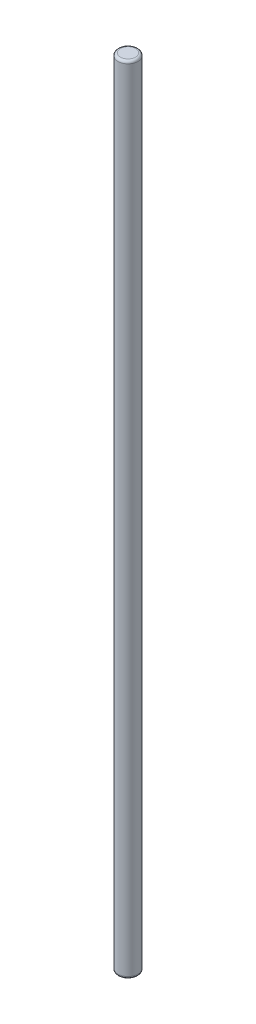
ISO-10303-21;
HEADER;
FILE_DESCRIPTION(('STEP AP214'),'2;1');
FILE_NAME('part.step','',(''),(''),'','','');
FILE_SCHEMA(('AUTOMOTIVE_DESIGN { 1 0 10303 214 1 1 1 1 }'));
ENDSEC;
DATA;
#1=APPLICATION_CONTEXT('core data for automotive mechanical design processes');
#2=APPLICATION_PROTOCOL_DEFINITION('international standard','automotive_design',2000,#1);
#3=PRODUCT_CONTEXT('',#1,'mechanical');
#4=PRODUCT('Part','Part','',(#3));
#5=PRODUCT_RELATED_PRODUCT_CATEGORY('part','',(#4));
#6=PRODUCT_DEFINITION_FORMATION('','',#4);
#7=PRODUCT_DEFINITION_CONTEXT('part definition',#1,'design');
#8=PRODUCT_DEFINITION('design','',#6,#7);
#9=PRODUCT_DEFINITION_SHAPE('','',#8);
#10=(LENGTH_UNIT() NAMED_UNIT(*) SI_UNIT(.MILLI.,.METRE.));
#11=(NAMED_UNIT(*) PLANE_ANGLE_UNIT() SI_UNIT($,.RADIAN.));
#12=(NAMED_UNIT(*) SI_UNIT($,.STERADIAN.) SOLID_ANGLE_UNIT());
#13=UNCERTAINTY_MEASURE_WITH_UNIT(LENGTH_MEASURE(1.E-05),#10,'distance_accuracy_value','');
#14=(GEOMETRIC_REPRESENTATION_CONTEXT(3) GLOBAL_UNCERTAINTY_ASSIGNED_CONTEXT((#13)) GLOBAL_UNIT_ASSIGNED_CONTEXT((#10,
#11,#12)) REPRESENTATION_CONTEXT('',''));
#15=CARTESIAN_POINT('',(0.,0.,0.));
#16=DIRECTION('',(0.,0.,1.));
#17=DIRECTION('',(1.,0.,0.));
#18=AXIS2_PLACEMENT_3D('',#15,#16,#17);
#19=CARTESIAN_POINT('',(0.,317.,0.));
#20=DIRECTION('',(0.,-1.,0.));
#21=DIRECTION('',(0.,0.,-1.));
#22=AXIS2_PLACEMENT_3D('',#19,#20,#21);
#23=CYLINDRICAL_SURFACE('',#22,4.);
#24=CARTESIAN_POINT('',(0.,1.,0.));
#25=DIRECTION('',(0.,1.,0.));
#26=DIRECTION('',(0.,0.,1.));
#27=AXIS2_PLACEMENT_3D('',#24,#25,#26);
#28=CIRCLE('',#27,4.);
#29=CARTESIAN_POINT('',(0.,1.,4.));
#30=VERTEX_POINT('',#29);
#31=EDGE_CURVE('E41',#30,#30,#28,.T.);
#32=ORIENTED_EDGE('',*,*,#31,.T.);
#33=EDGE_LOOP('',(#32));
#34=FACE_BOUND('',#33,.T.);
#35=CARTESIAN_POINT('',(0.,316.,0.));
#36=DIRECTION('',(0.,1.,0.));
#37=DIRECTION('',(0.,0.,1.));
#38=AXIS2_PLACEMENT_3D('',#35,#36,#37);
#39=CIRCLE('',#38,4.);
#40=CARTESIAN_POINT('',(0.,316.,4.));
#41=VERTEX_POINT('',#40);
#42=EDGE_CURVE('E45',#41,#41,#39,.F.);
#43=ORIENTED_EDGE('',*,*,#42,.T.);
#44=EDGE_LOOP('',(#43));
#45=FACE_BOUND('',#44,.T.);
#46=ADVANCED_FACE('F30',(#34,#45),#23,.T.);
#47=CARTESIAN_POINT('',(0.,317.,0.));
#48=DIRECTION('',(0.,1.,0.));
#49=DIRECTION('',(0.,0.,1.));
#50=AXIS2_PLACEMENT_3D('',#47,#48,#49);
#51=PLANE('',#50);
#52=CARTESIAN_POINT('',(0.,317.,0.));
#53=DIRECTION('',(0.,1.,0.));
#54=DIRECTION('',(0.,0.,1.));
#55=AXIS2_PLACEMENT_3D('',#52,#53,#54);
#56=CIRCLE('',#55,3.);
#57=CARTESIAN_POINT('',(0.,317.,3.));
#58=VERTEX_POINT('',#57);
#59=EDGE_CURVE('E10',#58,#58,#56,.T.);
#60=ORIENTED_EDGE('',*,*,#59,.T.);
#61=EDGE_LOOP('',(#60));
#62=FACE_BOUND('',#61,.T.);
#63=ADVANCED_FACE('F61',(#62),#51,.T.);
#64=CARTESIAN_POINT('',(0.,0.,0.));
#65=DIRECTION('',(0.,1.,0.));
#66=DIRECTION('',(0.,0.,1.));
#67=AXIS2_PLACEMENT_3D('',#64,#65,#66);
#68=PLANE('',#67);
#69=CARTESIAN_POINT('',(0.,0.,0.));
#70=DIRECTION('',(0.,1.,0.));
#71=DIRECTION('',(0.,0.,1.));
#72=AXIS2_PLACEMENT_3D('',#69,#70,#71);
#73=CIRCLE('',#72,3.);
#74=CARTESIAN_POINT('',(0.,0.,3.));
#75=VERTEX_POINT('',#74);
#76=EDGE_CURVE('E37',#75,#75,#73,.F.);
#77=ORIENTED_EDGE('',*,*,#76,.T.);
#78=EDGE_LOOP('',(#77));
#79=FACE_BOUND('',#78,.T.);
#80=ADVANCED_FACE('F58',(#79),#68,.F.);
#81=CARTESIAN_POINT('',(0.,1.,0.));
#82=DIRECTION('',(0.,1.,0.));
#83=DIRECTION('',(0.,0.,1.));
#84=AXIS2_PLACEMENT_3D('',#81,#82,#83);
#85=TOROIDAL_SURFACE('',#84,3.,1.);
#86=ORIENTED_EDGE('',*,*,#76,.F.);
#87=EDGE_LOOP('',(#86));
#88=FACE_BOUND('',#87,.T.);
#89=ORIENTED_EDGE('',*,*,#31,.F.);
#90=EDGE_LOOP('',(#89));
#91=FACE_BOUND('',#90,.T.);
#92=ADVANCED_FACE('F54',(#88,#91),#85,.T.);
#93=CARTESIAN_POINT('',(0.,316.,0.));
#94=DIRECTION('',(0.,1.,0.));
#95=DIRECTION('',(0.,0.,1.));
#96=AXIS2_PLACEMENT_3D('',#93,#94,#95);
#97=TOROIDAL_SURFACE('',#96,3.,1.);
#98=ORIENTED_EDGE('',*,*,#42,.F.);
#99=EDGE_LOOP('',(#98));
#100=FACE_BOUND('',#99,.T.);
#101=ORIENTED_EDGE('',*,*,#59,.F.);
#102=EDGE_LOOP('',(#101));
#103=FACE_BOUND('',#102,.T.);
#104=ADVANCED_FACE('F32',(#100,#103),#97,.T.);
#105=CLOSED_SHELL('',(#46,#63,#80,#92,#104));
#106=MANIFOLD_SOLID_BREP('B2',#105);
#107=ADVANCED_BREP_SHAPE_REPRESENTATION('',(#18,#106),#14);
#108=SHAPE_DEFINITION_REPRESENTATION(#9,#107);
ENDSEC;
END-ISO-10303-21;
